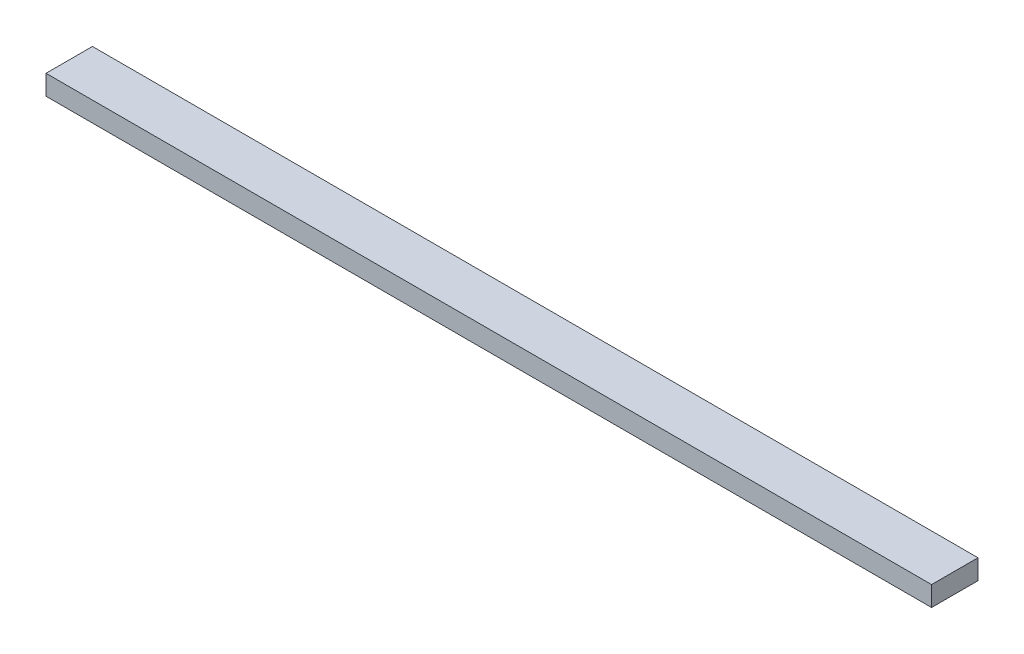
ISO-10303-21;
HEADER;
FILE_DESCRIPTION(('STEP AP214'),'2;1');
FILE_NAME('part.step','',(''),(''),'','','');
FILE_SCHEMA(('AUTOMOTIVE_DESIGN { 1 0 10303 214 1 1 1 1 }'));
ENDSEC;
DATA;
#1=APPLICATION_CONTEXT('core data for automotive mechanical design processes');
#2=APPLICATION_PROTOCOL_DEFINITION('international standard','automotive_design',2000,#1);
#3=PRODUCT_CONTEXT('',#1,'mechanical');
#4=PRODUCT('Part','Part','',(#3));
#5=PRODUCT_RELATED_PRODUCT_CATEGORY('part','',(#4));
#6=PRODUCT_DEFINITION_FORMATION('','',#4);
#7=PRODUCT_DEFINITION_CONTEXT('part definition',#1,'design');
#8=PRODUCT_DEFINITION('design','',#6,#7);
#9=PRODUCT_DEFINITION_SHAPE('','',#8);
#10=(LENGTH_UNIT() NAMED_UNIT(*) SI_UNIT(.MILLI.,.METRE.));
#11=(NAMED_UNIT(*) PLANE_ANGLE_UNIT() SI_UNIT($,.RADIAN.));
#12=(NAMED_UNIT(*) SI_UNIT($,.STERADIAN.) SOLID_ANGLE_UNIT());
#13=UNCERTAINTY_MEASURE_WITH_UNIT(LENGTH_MEASURE(1.E-05),#10,'distance_accuracy_value','');
#14=(GEOMETRIC_REPRESENTATION_CONTEXT(3) GLOBAL_UNCERTAINTY_ASSIGNED_CONTEXT((#13)) GLOBAL_UNIT_ASSIGNED_CONTEXT((#10,
#11,#12)) REPRESENTATION_CONTEXT('',''));
#15=CARTESIAN_POINT('',(0.,0.,0.));
#16=DIRECTION('',(0.,0.,1.));
#17=DIRECTION('',(1.,0.,0.));
#18=AXIS2_PLACEMENT_3D('',#15,#16,#17);
#19=CARTESIAN_POINT('',(0.,38.1,0.));
#20=DIRECTION('',(1.,0.,0.));
#21=DIRECTION('',(0.,0.,-1.));
#22=AXIS2_PLACEMENT_3D('',#19,#20,#21);
#23=PLANE('',#22);
#24=DIRECTION('',(0.,0.,1.));
#25=VECTOR('',#24,1.);
#26=CARTESIAN_POINT('',(0.,0.,0.));
#27=LINE('',#26,#25);
#28=CARTESIAN_POINT('',(0.,0.,-88.9));
#29=VERTEX_POINT('',#28);
#30=CARTESIAN_POINT('',(0.,0.,0.));
#31=VERTEX_POINT('',#30);
#32=EDGE_CURVE('E112',#29,#31,#27,.T.);
#33=ORIENTED_EDGE('',*,*,#32,.T.);
#34=DIRECTION('',(0.,-1.,0.));
#35=VECTOR('',#34,1.);
#36=CARTESIAN_POINT('',(0.,38.1,0.));
#37=LINE('',#36,#35);
#38=CARTESIAN_POINT('',(0.,38.1,0.));
#39=VERTEX_POINT('',#38);
#40=EDGE_CURVE('E11',#39,#31,#37,.T.);
#41=ORIENTED_EDGE('',*,*,#40,.F.);
#42=DIRECTION('',(0.,0.,1.));
#43=VECTOR('',#42,1.);
#44=CARTESIAN_POINT('',(0.,38.1,0.));
#45=LINE('',#44,#43);
#46=CARTESIAN_POINT('',(0.,38.1,-88.9));
#47=VERTEX_POINT('',#46);
#48=EDGE_CURVE('E93',#47,#39,#45,.T.);
#49=ORIENTED_EDGE('',*,*,#48,.F.);
#50=DIRECTION('',(0.,-1.,0.));
#51=VECTOR('',#50,1.);
#52=CARTESIAN_POINT('',(0.,38.1,-88.9));
#53=LINE('',#52,#51);
#54=EDGE_CURVE('E108',#47,#29,#53,.T.);
#55=ORIENTED_EDGE('',*,*,#54,.T.);
#56=EDGE_LOOP('',(#33,#41,#49,#55));
#57=FACE_BOUND('',#56,.T.);
#58=ADVANCED_FACE('F41',(#57),#23,.F.);
#59=CARTESIAN_POINT('',(0.,38.1,0.));
#60=DIRECTION('',(0.,0.,-1.));
#61=DIRECTION('',(-1.,0.,0.));
#62=AXIS2_PLACEMENT_3D('',#59,#60,#61);
#63=PLANE('',#62);
#64=DIRECTION('',(1.,0.,0.));
#65=VECTOR('',#64,1.);
#66=CARTESIAN_POINT('',(0.,0.,0.));
#67=LINE('',#66,#65);
#68=CARTESIAN_POINT('',(1695.45,0.,0.));
#69=VERTEX_POINT('',#68);
#70=EDGE_CURVE('E98',#31,#69,#67,.T.);
#71=ORIENTED_EDGE('',*,*,#70,.T.);
#72=DIRECTION('',(0.,-1.,0.));
#73=VECTOR('',#72,1.);
#74=CARTESIAN_POINT('',(1695.45,38.1,0.));
#75=LINE('',#74,#73);
#76=CARTESIAN_POINT('',(1695.45,38.1,0.));
#77=VERTEX_POINT('',#76);
#78=EDGE_CURVE('E50',#77,#69,#75,.T.);
#79=ORIENTED_EDGE('',*,*,#78,.F.);
#80=DIRECTION('',(1.,0.,0.));
#81=VECTOR('',#80,1.);
#82=CARTESIAN_POINT('',(0.,38.1,0.));
#83=LINE('',#82,#81);
#84=EDGE_CURVE('E88',#39,#77,#83,.T.);
#85=ORIENTED_EDGE('',*,*,#84,.F.);
#86=ORIENTED_EDGE('',*,*,#40,.T.);
#87=EDGE_LOOP('',(#71,#79,#85,#86));
#88=FACE_BOUND('',#87,.T.);
#89=ADVANCED_FACE('F97',(#88),#63,.F.);
#90=CARTESIAN_POINT('',(1695.45,38.1,0.));
#91=DIRECTION('',(-1.,0.,0.));
#92=DIRECTION('',(0.,0.,1.));
#93=AXIS2_PLACEMENT_3D('',#90,#91,#92);
#94=PLANE('',#93);
#95=DIRECTION('',(0.,0.,-1.));
#96=VECTOR('',#95,1.);
#97=CARTESIAN_POINT('',(1695.45,0.,0.));
#98=LINE('',#97,#96);
#99=CARTESIAN_POINT('',(1695.45,0.,-88.9));
#100=VERTEX_POINT('',#99);
#101=EDGE_CURVE('E75',#69,#100,#98,.T.);
#102=ORIENTED_EDGE('',*,*,#101,.T.);
#103=DIRECTION('',(0.,-1.,0.));
#104=VECTOR('',#103,1.);
#105=CARTESIAN_POINT('',(1695.45,38.1,-88.9));
#106=LINE('',#105,#104);
#107=CARTESIAN_POINT('',(1695.45,38.1,-88.9));
#108=VERTEX_POINT('',#107);
#109=EDGE_CURVE('E100',#108,#100,#106,.T.);
#110=ORIENTED_EDGE('',*,*,#109,.F.);
#111=DIRECTION('',(0.,0.,-1.));
#112=VECTOR('',#111,1.);
#113=CARTESIAN_POINT('',(1695.45,38.1,0.));
#114=LINE('',#113,#112);
#115=EDGE_CURVE('E91',#77,#108,#114,.T.);
#116=ORIENTED_EDGE('',*,*,#115,.F.);
#117=ORIENTED_EDGE('',*,*,#78,.T.);
#118=EDGE_LOOP('',(#102,#110,#116,#117));
#119=FACE_BOUND('',#118,.T.);
#120=ADVANCED_FACE('F101',(#119),#94,.F.);
#121=CARTESIAN_POINT('',(0.,38.1,-88.9));
#122=DIRECTION('',(0.,0.,1.));
#123=DIRECTION('',(1.,0.,0.));
#124=AXIS2_PLACEMENT_3D('',#121,#122,#123);
#125=PLANE('',#124);
#126=DIRECTION('',(-1.,0.,0.));
#127=VECTOR('',#126,1.);
#128=CARTESIAN_POINT('',(0.,0.,-88.9));
#129=LINE('',#128,#127);
#130=EDGE_CURVE('E81',#100,#29,#129,.T.);
#131=ORIENTED_EDGE('',*,*,#130,.T.);
#132=ORIENTED_EDGE('',*,*,#54,.F.);
#133=DIRECTION('',(-1.,0.,0.));
#134=VECTOR('',#133,1.);
#135=CARTESIAN_POINT('',(0.,38.1,-88.9));
#136=LINE('',#135,#134);
#137=EDGE_CURVE('E58',#108,#47,#136,.T.);
#138=ORIENTED_EDGE('',*,*,#137,.F.);
#139=ORIENTED_EDGE('',*,*,#109,.T.);
#140=EDGE_LOOP('',(#131,#132,#138,#139));
#141=FACE_BOUND('',#140,.T.);
#142=ADVANCED_FACE('F125',(#141),#125,.F.);
#143=CARTESIAN_POINT('',(0.,38.1,0.));
#144=DIRECTION('',(0.,-1.,0.));
#145=DIRECTION('',(0.,0.,-1.));
#146=AXIS2_PLACEMENT_3D('',#143,#144,#145);
#147=PLANE('',#146);
#148=ORIENTED_EDGE('',*,*,#48,.T.);
#149=ORIENTED_EDGE('',*,*,#84,.T.);
#150=ORIENTED_EDGE('',*,*,#115,.T.);
#151=ORIENTED_EDGE('',*,*,#137,.T.);
#152=EDGE_LOOP('',(#148,#149,#150,#151));
#153=FACE_BOUND('',#152,.T.);
#154=ADVANCED_FACE('F89',(#153),#147,.F.);
#155=CARTESIAN_POINT('',(0.,0.,0.));
#156=DIRECTION('',(0.,-1.,0.));
#157=DIRECTION('',(0.,0.,-1.));
#158=AXIS2_PLACEMENT_3D('',#155,#156,#157);
#159=PLANE('',#158);
#160=ORIENTED_EDGE('',*,*,#32,.F.);
#161=ORIENTED_EDGE('',*,*,#130,.F.);
#162=ORIENTED_EDGE('',*,*,#101,.F.);
#163=ORIENTED_EDGE('',*,*,#70,.F.);
#164=EDGE_LOOP('',(#160,#161,#162,#163));
#165=FACE_BOUND('',#164,.T.);
#166=ADVANCED_FACE('F128',(#165),#159,.T.);
#167=CLOSED_SHELL('',(#58,#89,#120,#142,#154,#166));
#168=MANIFOLD_SOLID_BREP('B2',#167);
#169=ADVANCED_BREP_SHAPE_REPRESENTATION('',(#18,#168),#14);
#170=SHAPE_DEFINITION_REPRESENTATION(#9,#169);
ENDSEC;
END-ISO-10303-21;
